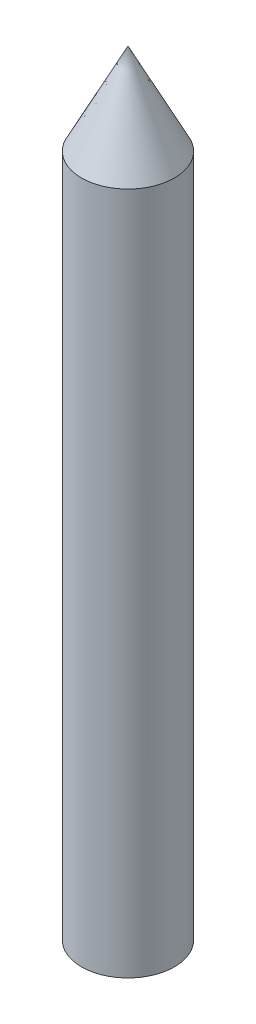
ISO-10303-21;
HEADER;
FILE_DESCRIPTION(('STEP AP214'),'2;1');
FILE_NAME('part.step','',(''),(''),'','','');
FILE_SCHEMA(('AUTOMOTIVE_DESIGN { 1 0 10303 214 1 1 1 1 }'));
ENDSEC;
DATA;
#1=APPLICATION_CONTEXT('core data for automotive mechanical design processes');
#2=APPLICATION_PROTOCOL_DEFINITION('international standard','automotive_design',2000,#1);
#3=PRODUCT_CONTEXT('',#1,'mechanical');
#4=PRODUCT('Part','Part','',(#3));
#5=PRODUCT_RELATED_PRODUCT_CATEGORY('part','',(#4));
#6=PRODUCT_DEFINITION_FORMATION('','',#4);
#7=PRODUCT_DEFINITION_CONTEXT('part definition',#1,'design');
#8=PRODUCT_DEFINITION('design','',#6,#7);
#9=PRODUCT_DEFINITION_SHAPE('','',#8);
#10=(LENGTH_UNIT() NAMED_UNIT(*) SI_UNIT(.MILLI.,.METRE.));
#11=(NAMED_UNIT(*) PLANE_ANGLE_UNIT() SI_UNIT($,.RADIAN.));
#12=(NAMED_UNIT(*) SI_UNIT($,.STERADIAN.) SOLID_ANGLE_UNIT());
#13=UNCERTAINTY_MEASURE_WITH_UNIT(LENGTH_MEASURE(1.E-05),#10,'distance_accuracy_value','');
#14=(GEOMETRIC_REPRESENTATION_CONTEXT(3) GLOBAL_UNCERTAINTY_ASSIGNED_CONTEXT((#13)) GLOBAL_UNIT_ASSIGNED_CONTEXT((#10,
#11,#12)) REPRESENTATION_CONTEXT('',''));
#15=CARTESIAN_POINT('',(0.,0.,0.));
#16=DIRECTION('',(0.,0.,1.));
#17=DIRECTION('',(1.,0.,0.));
#18=AXIS2_PLACEMENT_3D('',#15,#16,#17);
#19=CARTESIAN_POINT('',(0.,64.455081301,0.));
#20=DIRECTION('',(0.,-1.,0.));
#21=DIRECTION('',(1.,0.,0.));
#22=AXIS2_PLACEMENT_3D('',#19,#20,#21);
#23=CONICAL_SURFACE('',#22,0.,0.471644927398229);
#24=CARTESIAN_POINT('',(0.,64.455081301,0.));
#25=VERTEX_POINT('',#24);
#26=VERTEX_LOOP('',#25);
#27=FACE_BOUND('',#26,.T.);
#28=CARTESIAN_POINT('',(0.,52.691228794,0.));
#29=DIRECTION('',(0.,1.,0.));
#30=DIRECTION('',(0.,0.,1.));
#31=AXIS2_PLACEMENT_3D('',#28,#29,#30);
#32=CIRCLE('',#31,6.);
#33=CARTESIAN_POINT('',(0.,52.691228794,6.));
#34=VERTEX_POINT('',#33);
#35=EDGE_CURVE('E24',#34,#34,#32,.T.);
#36=ORIENTED_EDGE('',*,*,#35,.T.);
#37=EDGE_LOOP('',(#36));
#38=FACE_BOUND('',#37,.T.);
#39=ADVANCED_FACE('F17',(#27,#38),#23,.T.);
#40=CARTESIAN_POINT('',(-6.072,-35.544918699,6.072));
#41=DIRECTION('',(0.,-1.,0.));
#42=DIRECTION('',(0.,0.,-1.));
#43=AXIS2_PLACEMENT_3D('',#40,#41,#42);
#44=PLANE('',#43);
#45=CARTESIAN_POINT('',(0.,-35.544918699,0.));
#46=DIRECTION('',(0.,1.,0.));
#47=DIRECTION('',(0.,0.,1.));
#48=AXIS2_PLACEMENT_3D('',#45,#46,#47);
#49=CIRCLE('',#48,6.);
#50=CARTESIAN_POINT('',(0.,-35.544918699,6.));
#51=VERTEX_POINT('',#50);
#52=EDGE_CURVE('E11',#51,#51,#49,.F.);
#53=ORIENTED_EDGE('',*,*,#52,.T.);
#54=EDGE_LOOP('',(#53));
#55=FACE_BOUND('',#54,.T.);
#56=ADVANCED_FACE('F19',(#55),#44,.T.);
#57=CARTESIAN_POINT('',(0.,-35.544918699,0.));
#58=DIRECTION('',(0.,1.,0.));
#59=DIRECTION('',(0.,0.,1.));
#60=AXIS2_PLACEMENT_3D('',#57,#58,#59);
#61=CYLINDRICAL_SURFACE('',#60,6.);
#62=ORIENTED_EDGE('',*,*,#35,.F.);
#63=EDGE_LOOP('',(#62));
#64=FACE_BOUND('',#63,.T.);
#65=ORIENTED_EDGE('',*,*,#52,.F.);
#66=EDGE_LOOP('',(#65));
#67=FACE_BOUND('',#66,.T.);
#68=ADVANCED_FACE('F32',(#64,#67),#61,.T.);
#69=CLOSED_SHELL('',(#39,#56,#68));
#70=MANIFOLD_SOLID_BREP('B1',#69);
#71=ADVANCED_BREP_SHAPE_REPRESENTATION('',(#18,#70),#14);
#72=SHAPE_DEFINITION_REPRESENTATION(#9,#71);
ENDSEC;
END-ISO-10303-21;
